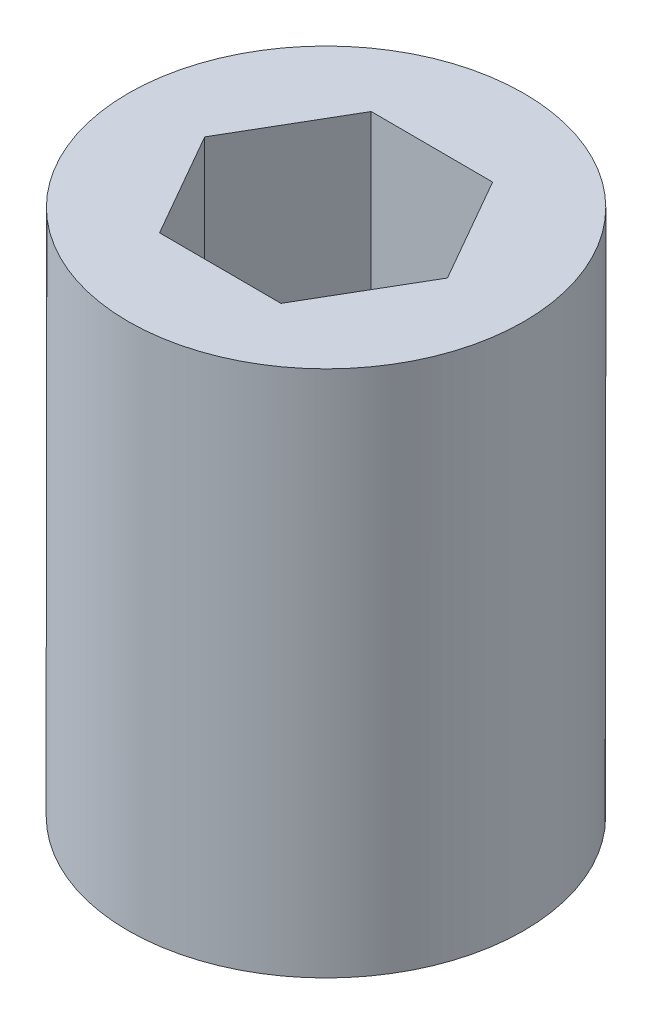
ISO-10303-21;
HEADER;
FILE_DESCRIPTION(('STEP AP214'),'2;1');
FILE_NAME('part.step','',(''),(''),'','','');
FILE_SCHEMA(('AUTOMOTIVE_DESIGN { 1 0 10303 214 1 1 1 1 }'));
ENDSEC;
DATA;
#1=APPLICATION_CONTEXT('core data for automotive mechanical design processes');
#2=APPLICATION_PROTOCOL_DEFINITION('international standard','automotive_design',2000,#1);
#3=PRODUCT_CONTEXT('',#1,'mechanical');
#4=PRODUCT('Part','Part','',(#3));
#5=PRODUCT_RELATED_PRODUCT_CATEGORY('part','',(#4));
#6=PRODUCT_DEFINITION_FORMATION('','',#4);
#7=PRODUCT_DEFINITION_CONTEXT('part definition',#1,'design');
#8=PRODUCT_DEFINITION('design','',#6,#7);
#9=PRODUCT_DEFINITION_SHAPE('','',#8);
#10=(LENGTH_UNIT() NAMED_UNIT(*) SI_UNIT(.MILLI.,.METRE.));
#11=(NAMED_UNIT(*) PLANE_ANGLE_UNIT() SI_UNIT($,.RADIAN.));
#12=(NAMED_UNIT(*) SI_UNIT($,.STERADIAN.) SOLID_ANGLE_UNIT());
#13=UNCERTAINTY_MEASURE_WITH_UNIT(LENGTH_MEASURE(1.E-05),#10,'distance_accuracy_value','');
#14=(GEOMETRIC_REPRESENTATION_CONTEXT(3) GLOBAL_UNCERTAINTY_ASSIGNED_CONTEXT((#13)) GLOBAL_UNIT_ASSIGNED_CONTEXT((#10,
#11,#12)) REPRESENTATION_CONTEXT('',''));
#15=CARTESIAN_POINT('',(0.,0.,0.));
#16=DIRECTION('',(0.,0.,1.));
#17=DIRECTION('',(1.,0.,0.));
#18=AXIS2_PLACEMENT_3D('',#15,#16,#17);
#19=CARTESIAN_POINT('',(7.82284209757141,5.00004242994869,0.12931637938664));
#20=DIRECTION('',(0.,0.999999946510797,-0.000327075531055362));
#21=DIRECTION('',(0.,0.000327075531055362,0.999999946510797));
#22=AXIS2_PLACEMENT_3D('',#19,#20,#21);
#23=PLANE('',#22);
#24=DIRECTION('',(0.497117681505411,0.000283797919865992,0.867683081656791));
#25=VECTOR('',#24,1.);
#26=CARTESIAN_POINT('',(4.36453768066593,4.99973870960886,-0.799277461372289));
#27=LINE('',#26,#25);
#28=CARTESIAN_POINT('',(4.36453768066538,4.99973820729856,-0.799277461207999));
#29=VERTEX_POINT('',#28);
#30=CARTESIAN_POINT('',(4.82375532424365,5.00000087089756,0.00225383585304466));
#31=VERTEX_POINT('',#30);
#32=EDGE_CURVE('E96',#29,#31,#27,.T.);
#33=ORIENTED_EDGE('',*,*,#32,.F.);
#34=DIRECTION('',(0.999994472094556,0.,0.00332502335797673));
#35=VECTOR('',#34,1.);
#36=CARTESIAN_POINT('',(4.3645355042149,4.99973770498825,-0.799277468280494));
#37=LINE('',#36,#35);
#38=CARTESIAN_POINT('',(3.44078194859939,4.99973770498825,-0.802348987408996));
#39=VERTEX_POINT('',#38);
#40=EDGE_CURVE('E81',#39,#29,#37,.T.);
#41=ORIENTED_EDGE('',*,*,#40,.F.);
#42=DIRECTION('',(0.502876790589736,-0.000282710386165704,-0.864358058654517));
#43=VECTOR('',#42,1.);
#44=CARTESIAN_POINT('',(2.97624467575638,4.99999886165634,-0.00388921350831256));
#45=LINE('',#44,#43);
#46=CARTESIAN_POINT('',(2.97624467575638,4.99999886165634,-0.00388921350831924));
#47=VERTEX_POINT('',#46);
#48=EDGE_CURVE('E65',#47,#39,#45,.T.);
#49=ORIENTED_EDGE('',*,*,#48,.F.);
#50=DIRECTION('',(-0.497117681505412,-0.000283797919868809,-0.86768308165679));
#51=VECTOR('',#50,1.);
#52=CARTESIAN_POINT('',(3.4354623193341,5.00026102294503,0.797642083717013));
#53=LINE('',#52,#51);
#54=CARTESIAN_POINT('',(3.43546231933436,5.0002612741002,0.797642083634869));
#55=VERTEX_POINT('',#54);
#56=EDGE_CURVE('E70',#55,#47,#53,.T.);
#57=ORIENTED_EDGE('',*,*,#56,.F.);
#58=DIRECTION('',(-0.999994472094556,0.,-0.00332502335797678));
#59=VECTOR('',#58,1.);
#60=CARTESIAN_POINT('',(3.43546014288526,5.00026202756563,0.797642076151644));
#61=LINE('',#60,#59);
#62=CARTESIAN_POINT('',(4.35921723575481,5.00026202756564,0.800713607041668));
#63=VERTEX_POINT('',#62);
#64=EDGE_CURVE('E104',#63,#55,#61,.T.);
#65=ORIENTED_EDGE('',*,*,#64,.F.);
#66=DIRECTION('',(-0.502876790589736,0.000282710386158191,0.864358058654517));
#67=VECTOR('',#66,1.);
#68=CARTESIAN_POINT('',(4.82375532424365,5.00000087089755,0.00225383585304222));
#69=LINE('',#68,#67);
#70=EDGE_CURVE('E101',#31,#63,#69,.T.);
#71=ORIENTED_EDGE('',*,*,#70,.F.);
#72=EDGE_LOOP('',(#33,#41,#49,#57,#65,#71));
#73=FACE_BOUND('',#72,.T.);
#74=ADVANCED_FACE('F17',(#73),#23,.T.);
#75=CARTESIAN_POINT('',(2.97624467575639,7.00128093616331,-0.00454378394064195));
#76=DIRECTION('',(0.867683128068469,-0.00016259502967945,-0.497117654914983));
#77=DIRECTION('',(-0.497117661486169,0.,-0.867683139538001));
#78=AXIS2_PLACEMENT_3D('',#75,#76,#77);
#79=PLANE('',#78);
#80=ORIENTED_EDGE('',*,*,#56,.T.);
#81=DIRECTION('',(0.,-0.999999946510797,0.000327075531058451));
#82=VECTOR('',#81,1.);
#83=CARTESIAN_POINT('',(2.97624467575639,6.49999878142252,-0.00437982680490023));
#84=LINE('',#83,#82);
#85=CARTESIAN_POINT('',(2.97624467575639,6.49999878142252,-0.00437982680489987));
#86=VERTEX_POINT('',#85);
#87=EDGE_CURVE('E72',#86,#47,#84,.T.);
#88=ORIENTED_EDGE('',*,*,#87,.F.);
#89=DIRECTION('',(-0.4971176815054,-0.00028379791989886,-0.867683081656797));
#90=VECTOR('',#89,1.);
#91=CARTESIAN_POINT('',(3.43546231933409,6.50026094271123,0.79715147042043));
#92=LINE('',#91,#90);
#93=CARTESIAN_POINT('',(3.43546272715701,6.50026094271124,0.797151471776456));
#94=VERTEX_POINT('',#93);
#95=EDGE_CURVE('E107',#94,#86,#92,.T.);
#96=ORIENTED_EDGE('',*,*,#95,.F.);
#97=DIRECTION('',(1.08752776879847E-06,0.999999946511388,-0.00032707191498033));
#98=VECTOR('',#97,1.);
#99=CARTESIAN_POINT('',(3.43546449578404,7.00154309745204,0.796987520521478));
#100=LINE('',#99,#98);
#101=EDGE_CURVE('E75',#55,#94,#100,.T.);
#102=ORIENTED_EDGE('',*,*,#101,.F.);
#103=EDGE_LOOP('',(#80,#88,#96,#102));
#104=FACE_BOUND('',#103,.T.);
#105=ADVANCED_FACE('F71',(#104),#79,.T.);
#106=CARTESIAN_POINT('',(3.44078235642231,7.0010197794952,-0.803003556485292));
#107=DIRECTION('',(0.864358104888343,0.000164478693333505,0.502876763691257));
#108=DIRECTION('',(0.50287677049348,0.,-0.864358116580187));
#109=AXIS2_PLACEMENT_3D('',#106,#107,#108);
#110=PLANE('',#109);
#111=ORIENTED_EDGE('',*,*,#48,.T.);
#112=DIRECTION('',(1.08752776879845E-06,0.999999946511388,-0.00032707191498033));
#113=VECTOR('',#112,1.);
#114=CARTESIAN_POINT('',(3.4407829015817,7.00102078411581,-0.803003555001201));
#115=LINE('',#114,#113);
#116=CARTESIAN_POINT('',(3.44078235642258,6.49973787590959,-0.802839599431699));
#117=VERTEX_POINT('',#116);
#118=EDGE_CURVE('E83',#117,#39,#115,.F.);
#119=ORIENTED_EDGE('',*,*,#118,.F.);
#120=DIRECTION('',(0.502876790589736,-0.000282710386180727,-0.864358058654516));
#121=VECTOR('',#120,1.);
#122=CARTESIAN_POINT('',(2.97624467575639,6.49999878142251,-0.00437982680490007));
#123=LINE('',#122,#121);
#124=EDGE_CURVE('E87',#86,#117,#123,.T.);
#125=ORIENTED_EDGE('',*,*,#124,.F.);
#126=ORIENTED_EDGE('',*,*,#87,.T.);
#127=EDGE_LOOP('',(#111,#119,#125,#126));
#128=FACE_BOUND('',#127,.T.);
#129=ADVANCED_FACE('F85',(#128),#110,.T.);
#130=CARTESIAN_POINT('',(4.36453768066594,7.00102078411581,-0.799932031804614));
#131=DIRECTION('',(-0.00332502318012585,0.000327073723012944,0.99999441860624));
#132=DIRECTION('',(0.999994472094556,0.,0.00332502335797673));
#133=AXIS2_PLACEMENT_3D('',#130,#131,#132);
#134=PLANE('',#133);
#135=ORIENTED_EDGE('',*,*,#40,.T.);
#136=DIRECTION('',(0.,-0.999999946510797,0.000327075531054483));
#137=VECTOR('',#136,1.);
#138=CARTESIAN_POINT('',(4.36453768066593,6.49973862937505,-0.799768074668871));
#139=LINE('',#138,#137);
#140=CARTESIAN_POINT('',(4.36453849631176,6.49973862937505,-0.799768071956817));
#141=VERTEX_POINT('',#140);
#142=EDGE_CURVE('E93',#141,#29,#139,.T.);
#143=ORIENTED_EDGE('',*,*,#142,.F.);
#144=DIRECTION('',(0.999994472095147,1.08753371812882E-06,0.00332502300227364));
#145=VECTOR('',#144,1.);
#146=CARTESIAN_POINT('',(3.44078235642231,6.49973762475441,-0.802839599349554));
#147=LINE('',#146,#145);
#148=EDGE_CURVE('E110',#117,#141,#147,.T.);
#149=ORIENTED_EDGE('',*,*,#148,.F.);
#150=ORIENTED_EDGE('',*,*,#118,.T.);
#151=EDGE_LOOP('',(#135,#143,#149,#150));
#152=FACE_BOUND('',#151,.T.);
#153=ADVANCED_FACE('F185',(#152),#134,.T.);
#154=CARTESIAN_POINT('',(4.82375532424365,7.00128294540453,0.00159926542071767));
#155=DIRECTION('',(-0.867683128068469,0.00016259502967945,0.497117654914983));
#156=DIRECTION('',(0.497117661486169,0.,0.867683139538001));
#157=AXIS2_PLACEMENT_3D('',#154,#155,#156);
#158=PLANE('',#157);
#159=ORIENTED_EDGE('',*,*,#32,.T.);
#160=DIRECTION('',(0.,-0.999999946510797,0.000327075531054468));
#161=VECTOR('',#160,1.);
#162=CARTESIAN_POINT('',(4.82375532424366,6.50000079066377,0.0017632225564605));
#163=LINE('',#162,#161);
#164=CARTESIAN_POINT('',(4.82375532424365,6.50000079066376,0.00176322255645878));
#165=VERTEX_POINT('',#164);
#166=EDGE_CURVE('E98',#165,#31,#163,.T.);
#167=ORIENTED_EDGE('',*,*,#166,.F.);
#168=DIRECTION('',(0.497117681505407,0.000283797919898857,0.867683081656793));
#169=VECTOR('',#168,1.);
#170=CARTESIAN_POINT('',(4.36453768066594,6.49973862937503,-0.799768074668875));
#171=LINE('',#170,#169);
#172=EDGE_CURVE('E113',#141,#165,#171,.T.);
#173=ORIENTED_EDGE('',*,*,#172,.F.);
#174=ORIENTED_EDGE('',*,*,#142,.T.);
#175=EDGE_LOOP('',(#159,#167,#173,#174));
#176=FACE_BOUND('',#175,.T.);
#177=ADVANCED_FACE('F176',(#176),#158,.T.);
#178=CARTESIAN_POINT('',(4.35921764357774,7.00154410207265,0.800059037965371));
#179=DIRECTION('',(-0.864358104888343,-0.000164478693333505,-0.502876763691257));
#180=DIRECTION('',(-0.50287677049348,0.,0.864358116580187));
#181=AXIS2_PLACEMENT_3D('',#178,#179,#180);
#182=PLANE('',#181);
#183=ORIENTED_EDGE('',*,*,#70,.T.);
#184=DIRECTION('',(1.08752776879847E-06,0.999999946511388,-0.00032707191498033));
#185=VECTOR('',#184,1.);
#186=CARTESIAN_POINT('',(4.35921818873494,7.00154309745204,0.800059040106627));
#187=LINE('',#186,#185);
#188=CARTESIAN_POINT('',(4.35921764357747,6.5002616961767,0.800222995183255));
#189=VERTEX_POINT('',#188);
#190=EDGE_CURVE('E33',#189,#63,#187,.F.);
#191=ORIENTED_EDGE('',*,*,#190,.F.);
#192=DIRECTION('',(-0.502876790589729,0.000282710386180729,0.864358058654521));
#193=VECTOR('',#192,1.);
#194=CARTESIAN_POINT('',(4.82375532424365,6.50000079066375,0.00176322255645738));
#195=LINE('',#194,#193);
#196=EDGE_CURVE('E116',#165,#189,#195,.T.);
#197=ORIENTED_EDGE('',*,*,#196,.F.);
#198=ORIENTED_EDGE('',*,*,#166,.T.);
#199=EDGE_LOOP('',(#183,#191,#197,#198));
#200=FACE_BOUND('',#199,.T.);
#201=ADVANCED_FACE('F139',(#200),#182,.T.);
#202=CARTESIAN_POINT('',(3.43546231933411,7.00154309745204,0.796987513284691));
#203=DIRECTION('',(0.0033250231801259,-0.000327073723012944,-0.99999441860624));
#204=DIRECTION('',(-0.999994472094556,0.,-0.00332502335797678));
#205=AXIS2_PLACEMENT_3D('',#202,#203,#204);
#206=PLANE('',#205);
#207=ORIENTED_EDGE('',*,*,#64,.T.);
#208=ORIENTED_EDGE('',*,*,#101,.T.);
#209=DIRECTION('',(-0.999994472095147,-1.0875337181288E-06,-0.00332502300227462));
#210=VECTOR('',#209,1.);
#211=CARTESIAN_POINT('',(4.35921764357774,6.50026194733185,0.80022299510111));
#212=LINE('',#211,#210);
#213=EDGE_CURVE('E119',#189,#94,#212,.T.);
#214=ORIENTED_EDGE('',*,*,#213,.F.);
#215=ORIENTED_EDGE('',*,*,#190,.T.);
#216=EDGE_LOOP('',(#207,#208,#214,#215));
#217=FACE_BOUND('',#216,.T.);
#218=ADVANCED_FACE('F130',(#217),#206,.T.);
#219=CARTESIAN_POINT('',(3.90000000000002,6.49999978604313,-0.00130830212422028));
#220=DIRECTION('',(0.,0.999999946510797,-0.000327075531055362));
#221=DIRECTION('',(0.,0.000327075531055362,0.999999946510797));
#222=AXIS2_PLACEMENT_3D('',#219,#220,#221);
#223=PLANE('',#222);
#224=ORIENTED_EDGE('',*,*,#196,.T.);
#225=ORIENTED_EDGE('',*,*,#213,.T.);
#226=ORIENTED_EDGE('',*,*,#95,.T.);
#227=ORIENTED_EDGE('',*,*,#124,.T.);
#228=ORIENTED_EDGE('',*,*,#148,.T.);
#229=ORIENTED_EDGE('',*,*,#172,.T.);
#230=EDGE_LOOP('',(#224,#225,#226,#227,#228,#229));
#231=FACE_BOUND('',#230,.T.);
#232=CARTESIAN_POINT('',(3.90000000000002,6.49999978604313,-0.00130830212422141));
#233=DIRECTION('',(0.,0.999999946510797,-0.000327075531055362));
#234=DIRECTION('',(0.,0.000327075531055362,0.999999946510797));
#235=AXIS2_PLACEMENT_3D('',#232,#233,#234);
#236=CIRCLE('',#235,1.5);
#237=CARTESIAN_POINT('',(3.90000000000002,6.50049039933971,1.49869161764197));
#238=VERTEX_POINT('',#237);
#239=EDGE_CURVE('E20',#238,#238,#236,.F.);
#240=ORIENTED_EDGE('',*,*,#239,.F.);
#241=EDGE_LOOP('',(#240));
#242=FACE_BOUND('',#241,.T.);
#243=ADVANCED_FACE('F127',(#231,#242),#223,.T.);
#244=CARTESIAN_POINT('',(3.9,2.49999999999998,0.));
#245=DIRECTION('',(0.,0.999999946510797,-0.000327075531055362));
#246=DIRECTION('',(0.,0.000327075531055362,0.999999946510797));
#247=AXIS2_PLACEMENT_3D('',#244,#245,#246);
#248=PLANE('',#247);
#249=CARTESIAN_POINT('',(3.9,2.49999999999999,0.));
#250=DIRECTION('',(0.,0.999999946510797,-0.000327075531055362));
#251=DIRECTION('',(0.,0.000327075531055362,0.999999946510797));
#252=AXIS2_PLACEMENT_3D('',#249,#250,#251);
#253=CIRCLE('',#252,1.5);
#254=CARTESIAN_POINT('',(3.9,2.50049061329657,1.4999999197662));
#255=VERTEX_POINT('',#254);
#256=EDGE_CURVE('E11',#255,#255,#253,.T.);
#257=ORIENTED_EDGE('',*,*,#256,.F.);
#258=EDGE_LOOP('',(#257));
#259=FACE_BOUND('',#258,.T.);
#260=ADVANCED_FACE('F129',(#259),#248,.F.);
#261=CARTESIAN_POINT('',(3.9,2.49999999999998,0.));
#262=DIRECTION('',(0.,0.999999946510797,-0.000327075531055362));
#263=DIRECTION('',(0.,0.000327075531055362,0.999999946510797));
#264=AXIS2_PLACEMENT_3D('',#261,#262,#263);
#265=CYLINDRICAL_SURFACE('',#264,1.5);
#266=ORIENTED_EDGE('',*,*,#256,.T.);
#267=EDGE_LOOP('',(#266));
#268=FACE_BOUND('',#267,.T.);
#269=ORIENTED_EDGE('',*,*,#239,.T.);
#270=EDGE_LOOP('',(#269));
#271=FACE_BOUND('',#270,.T.);
#272=ADVANCED_FACE('F125',(#268,#271),#265,.T.);
#273=CLOSED_SHELL('',(#74,#105,#129,#153,#177,#201,#218,#243,#260,#272));
#274=MANIFOLD_SOLID_BREP('B1',#273);
#275=ADVANCED_BREP_SHAPE_REPRESENTATION('',(#18,#274),#14);
#276=SHAPE_DEFINITION_REPRESENTATION(#9,#275);
ENDSEC;
END-ISO-10303-21;
